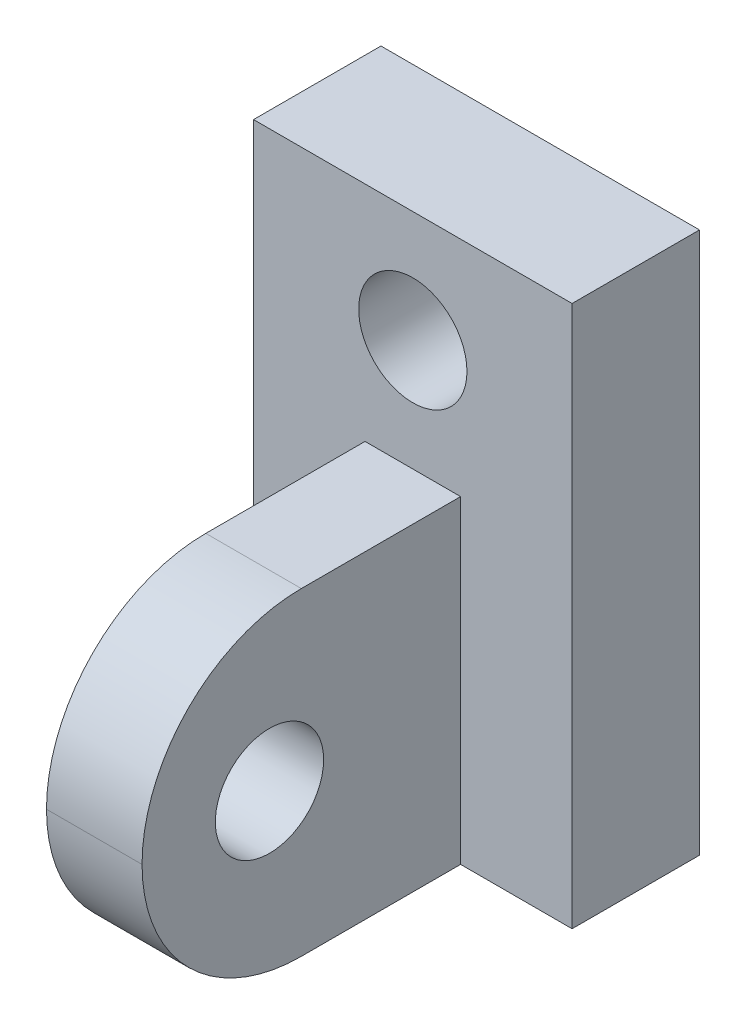
ISO-10303-21;
HEADER;
FILE_DESCRIPTION(('STEP AP214'),'2;1');
FILE_NAME('part.step','',(''),(''),'','','');
FILE_SCHEMA(('AUTOMOTIVE_DESIGN { 1 0 10303 214 1 1 1 1 }'));
ENDSEC;
DATA;
#1=APPLICATION_CONTEXT('core data for automotive mechanical design processes');
#2=APPLICATION_PROTOCOL_DEFINITION('international standard','automotive_design',2000,#1);
#3=PRODUCT_CONTEXT('',#1,'mechanical');
#4=PRODUCT('Part','Part','',(#3));
#5=PRODUCT_RELATED_PRODUCT_CATEGORY('part','',(#4));
#6=PRODUCT_DEFINITION_FORMATION('','',#4);
#7=PRODUCT_DEFINITION_CONTEXT('part definition',#1,'design');
#8=PRODUCT_DEFINITION('design','',#6,#7);
#9=PRODUCT_DEFINITION_SHAPE('','',#8);
#10=(LENGTH_UNIT() NAMED_UNIT(*) SI_UNIT(.MILLI.,.METRE.));
#11=(NAMED_UNIT(*) PLANE_ANGLE_UNIT() SI_UNIT($,.RADIAN.));
#12=(NAMED_UNIT(*) SI_UNIT($,.STERADIAN.) SOLID_ANGLE_UNIT());
#13=UNCERTAINTY_MEASURE_WITH_UNIT(LENGTH_MEASURE(1.E-05),#10,'distance_accuracy_value','');
#14=(GEOMETRIC_REPRESENTATION_CONTEXT(3) GLOBAL_UNCERTAINTY_ASSIGNED_CONTEXT((#13)) GLOBAL_UNIT_ASSIGNED_CONTEXT((#10,
#11,#12)) REPRESENTATION_CONTEXT('',''));
#15=CARTESIAN_POINT('',(0.,0.,0.));
#16=DIRECTION('',(0.,0.,1.));
#17=DIRECTION('',(1.,0.,0.));
#18=AXIS2_PLACEMENT_3D('',#15,#16,#17);
#19=CARTESIAN_POINT('',(0.,0.,4.));
#20=DIRECTION('',(-1.,0.,0.));
#21=DIRECTION('',(0.,0.,1.));
#22=AXIS2_PLACEMENT_3D('',#19,#20,#21);
#23=PLANE('',#22);
#24=DIRECTION('',(0.,1.,0.));
#25=VECTOR('',#24,1.);
#26=CARTESIAN_POINT('',(0.,0.,0.));
#27=LINE('',#26,#25);
#28=CARTESIAN_POINT('',(0.,0.,0.));
#29=VERTEX_POINT('',#28);
#30=CARTESIAN_POINT('',(0.,17.,0.));
#31=VERTEX_POINT('',#30);
#32=EDGE_CURVE('E191',#29,#31,#27,.T.);
#33=ORIENTED_EDGE('',*,*,#32,.F.);
#34=DIRECTION('',(0.,0.,-1.));
#35=VECTOR('',#34,1.);
#36=CARTESIAN_POINT('',(0.,0.,4.));
#37=LINE('',#36,#35);
#38=CARTESIAN_POINT('',(0.,0.,4.));
#39=VERTEX_POINT('',#38);
#40=EDGE_CURVE('E108',#39,#29,#37,.T.);
#41=ORIENTED_EDGE('',*,*,#40,.F.);
#42=DIRECTION('',(0.,1.,0.));
#43=VECTOR('',#42,1.);
#44=CARTESIAN_POINT('',(0.,0.,4.));
#45=LINE('',#44,#43);
#46=CARTESIAN_POINT('',(0.,17.,4.));
#47=VERTEX_POINT('',#46);
#48=EDGE_CURVE('E103',#39,#47,#45,.T.);
#49=ORIENTED_EDGE('',*,*,#48,.T.);
#50=DIRECTION('',(0.,0.,1.));
#51=VECTOR('',#50,1.);
#52=CARTESIAN_POINT('',(0.,17.,4.));
#53=LINE('',#52,#51);
#54=EDGE_CURVE('E107',#31,#47,#53,.T.);
#55=ORIENTED_EDGE('',*,*,#54,.F.);
#56=EDGE_LOOP('',(#33,#41,#49,#55));
#57=FACE_BOUND('',#56,.T.);
#58=ADVANCED_FACE('F34',(#57),#23,.T.);
#59=CARTESIAN_POINT('',(0.,0.,4.));
#60=DIRECTION('',(0.,1.,0.));
#61=DIRECTION('',(0.,0.,1.));
#62=AXIS2_PLACEMENT_3D('',#59,#60,#61);
#63=PLANE('',#62);
#64=DIRECTION('',(0.,0.,-1.));
#65=VECTOR('',#64,1.);
#66=CARTESIAN_POINT('',(6.5,0.,14.));
#67=LINE('',#66,#65);
#68=CARTESIAN_POINT('',(6.5,0.,9.));
#69=VERTEX_POINT('',#68);
#70=CARTESIAN_POINT('',(6.5,0.,4.));
#71=VERTEX_POINT('',#70);
#72=EDGE_CURVE('E155',#69,#71,#67,.T.);
#73=ORIENTED_EDGE('',*,*,#72,.F.);
#74=DIRECTION('',(1.,0.,0.));
#75=VECTOR('',#74,1.);
#76=CARTESIAN_POINT('',(3.5,0.,9.));
#77=LINE('',#76,#75);
#78=CARTESIAN_POINT('',(3.5,0.,9.));
#79=VERTEX_POINT('',#78);
#80=EDGE_CURVE('E166',#69,#79,#77,.F.);
#81=ORIENTED_EDGE('',*,*,#80,.T.);
#82=DIRECTION('',(0.,0.,-1.));
#83=VECTOR('',#82,1.);
#84=CARTESIAN_POINT('',(3.5,0.,14.));
#85=LINE('',#84,#83);
#86=CARTESIAN_POINT('',(3.5,0.,4.));
#87=VERTEX_POINT('',#86);
#88=EDGE_CURVE('E162',#79,#87,#85,.T.);
#89=ORIENTED_EDGE('',*,*,#88,.T.);
#90=DIRECTION('',(1.,0.,0.));
#91=VECTOR('',#90,1.);
#92=CARTESIAN_POINT('',(0.,0.,4.));
#93=LINE('',#92,#91);
#94=EDGE_CURVE('E184',#39,#87,#93,.T.);
#95=ORIENTED_EDGE('',*,*,#94,.F.);
#96=ORIENTED_EDGE('',*,*,#40,.T.);
#97=DIRECTION('',(1.,0.,0.));
#98=VECTOR('',#97,1.);
#99=CARTESIAN_POINT('',(0.,0.,0.));
#100=LINE('',#99,#98);
#101=CARTESIAN_POINT('',(10.,0.,0.));
#102=VERTEX_POINT('',#101);
#103=EDGE_CURVE('E193',#29,#102,#100,.T.);
#104=ORIENTED_EDGE('',*,*,#103,.T.);
#105=DIRECTION('',(0.,0.,-1.));
#106=VECTOR('',#105,1.);
#107=CARTESIAN_POINT('',(10.,0.,4.));
#108=LINE('',#107,#106);
#109=CARTESIAN_POINT('',(10.,0.,4.));
#110=VERTEX_POINT('',#109);
#111=EDGE_CURVE('E190',#110,#102,#108,.T.);
#112=ORIENTED_EDGE('',*,*,#111,.F.);
#113=EDGE_CURVE('E112',#71,#110,#93,.T.);
#114=ORIENTED_EDGE('',*,*,#113,.F.);
#115=EDGE_LOOP('',(#73,#81,#89,#95,#96,#104,#112,#114));
#116=FACE_BOUND('',#115,.T.);
#117=ADVANCED_FACE('F206',(#116),#63,.F.);
#118=CARTESIAN_POINT('',(10.,0.,4.));
#119=DIRECTION('',(-1.,0.,0.));
#120=DIRECTION('',(0.,0.,1.));
#121=AXIS2_PLACEMENT_3D('',#118,#119,#120);
#122=PLANE('',#121);
#123=DIRECTION('',(0.,1.,0.));
#124=VECTOR('',#123,1.);
#125=CARTESIAN_POINT('',(10.,0.,0.));
#126=LINE('',#125,#124);
#127=CARTESIAN_POINT('',(10.,17.,0.));
#128=VERTEX_POINT('',#127);
#129=EDGE_CURVE('E113',#102,#128,#126,.T.);
#130=ORIENTED_EDGE('',*,*,#129,.T.);
#131=DIRECTION('',(0.,0.,-1.));
#132=VECTOR('',#131,1.);
#133=CARTESIAN_POINT('',(10.,17.,4.));
#134=LINE('',#133,#132);
#135=CARTESIAN_POINT('',(10.,17.,4.));
#136=VERTEX_POINT('',#135);
#137=EDGE_CURVE('E123',#136,#128,#134,.T.);
#138=ORIENTED_EDGE('',*,*,#137,.F.);
#139=DIRECTION('',(0.,1.,0.));
#140=VECTOR('',#139,1.);
#141=CARTESIAN_POINT('',(10.,0.,4.));
#142=LINE('',#141,#140);
#143=EDGE_CURVE('E119',#110,#136,#142,.T.);
#144=ORIENTED_EDGE('',*,*,#143,.F.);
#145=ORIENTED_EDGE('',*,*,#111,.T.);
#146=EDGE_LOOP('',(#130,#138,#144,#145));
#147=FACE_BOUND('',#146,.T.);
#148=ADVANCED_FACE('F224',(#147),#122,.F.);
#149=CARTESIAN_POINT('',(0.,0.,4.));
#150=DIRECTION('',(0.,0.,1.));
#151=DIRECTION('',(1.,0.,0.));
#152=AXIS2_PLACEMENT_3D('',#149,#150,#151);
#153=PLANE('',#152);
#154=CARTESIAN_POINT('',(5.,13.5,4.));
#155=DIRECTION('',(0.,0.,1.));
#156=DIRECTION('',(1.,0.,0.));
#157=AXIS2_PLACEMENT_3D('',#154,#155,#156);
#158=CIRCLE('',#157,1.69999999999999);
#159=CARTESIAN_POINT('',(6.69999999999999,13.5,4.));
#160=VERTEX_POINT('',#159);
#161=EDGE_CURVE('E138',#160,#160,#158,.T.);
#162=ORIENTED_EDGE('',*,*,#161,.F.);
#163=EDGE_LOOP('',(#162));
#164=FACE_BOUND('',#163,.T.);
#165=DIRECTION('',(1.,0.,0.));
#166=VECTOR('',#165,1.);
#167=CARTESIAN_POINT('',(0.,17.,4.));
#168=LINE('',#167,#166);
#169=EDGE_CURVE('E116',#47,#136,#168,.T.);
#170=ORIENTED_EDGE('',*,*,#169,.F.);
#171=ORIENTED_EDGE('',*,*,#48,.F.);
#172=ORIENTED_EDGE('',*,*,#94,.T.);
#173=DIRECTION('',(0.,-1.,0.));
#174=VECTOR('',#173,1.);
#175=CARTESIAN_POINT('',(3.5,10.,4.));
#176=LINE('',#175,#174);
#177=CARTESIAN_POINT('',(3.5,10.,4.));
#178=VERTEX_POINT('',#177);
#179=EDGE_CURVE('E145',#178,#87,#176,.T.);
#180=ORIENTED_EDGE('',*,*,#179,.F.);
#181=DIRECTION('',(-1.,0.,0.));
#182=VECTOR('',#181,1.);
#183=CARTESIAN_POINT('',(3.5,10.,4.));
#184=LINE('',#183,#182);
#185=CARTESIAN_POINT('',(6.5,10.,4.));
#186=VERTEX_POINT('',#185);
#187=EDGE_CURVE('E142',#186,#178,#184,.T.);
#188=ORIENTED_EDGE('',*,*,#187,.F.);
#189=DIRECTION('',(0.,1.,0.));
#190=VECTOR('',#189,1.);
#191=CARTESIAN_POINT('',(6.5,10.,4.));
#192=LINE('',#191,#190);
#193=EDGE_CURVE('E146',#71,#186,#192,.T.);
#194=ORIENTED_EDGE('',*,*,#193,.F.);
#195=ORIENTED_EDGE('',*,*,#113,.T.);
#196=ORIENTED_EDGE('',*,*,#143,.T.);
#197=EDGE_LOOP('',(#170,#171,#172,#180,#188,#194,#195,#196));
#198=FACE_BOUND('',#197,.T.);
#199=ADVANCED_FACE('F117',(#164,#198),#153,.T.);
#200=CARTESIAN_POINT('',(0.,0.,0.));
#201=DIRECTION('',(0.,0.,1.));
#202=DIRECTION('',(1.,0.,0.));
#203=AXIS2_PLACEMENT_3D('',#200,#201,#202);
#204=PLANE('',#203);
#205=CARTESIAN_POINT('',(5.,13.5,0.));
#206=DIRECTION('',(0.,0.,1.));
#207=DIRECTION('',(1.,0.,0.));
#208=AXIS2_PLACEMENT_3D('',#205,#206,#207);
#209=CIRCLE('',#208,1.69999999999999);
#210=CARTESIAN_POINT('',(6.69999999999999,13.5,0.));
#211=VERTEX_POINT('',#210);
#212=EDGE_CURVE('E11',#211,#211,#209,.T.);
#213=ORIENTED_EDGE('',*,*,#212,.T.);
#214=EDGE_LOOP('',(#213));
#215=FACE_BOUND('',#214,.T.);
#216=ORIENTED_EDGE('',*,*,#32,.T.);
#217=DIRECTION('',(-1.,0.,0.));
#218=VECTOR('',#217,1.);
#219=CARTESIAN_POINT('',(0.,17.,0.));
#220=LINE('',#219,#218);
#221=EDGE_CURVE('E128',#128,#31,#220,.T.);
#222=ORIENTED_EDGE('',*,*,#221,.F.);
#223=ORIENTED_EDGE('',*,*,#129,.F.);
#224=ORIENTED_EDGE('',*,*,#103,.F.);
#225=EDGE_LOOP('',(#216,#222,#223,#224));
#226=FACE_BOUND('',#225,.T.);
#227=ADVANCED_FACE('F230',(#215,#226),#204,.F.);
#228=CARTESIAN_POINT('',(6.5,10.,14.));
#229=DIRECTION('',(-1.,0.,0.));
#230=DIRECTION('',(0.,-1.,0.));
#231=AXIS2_PLACEMENT_3D('',#228,#229,#230);
#232=PLANE('',#231);
#233=CARTESIAN_POINT('',(6.5,5.,10.));
#234=DIRECTION('',(1.,0.,0.));
#235=DIRECTION('',(0.,0.,-1.));
#236=AXIS2_PLACEMENT_3D('',#233,#234,#235);
#237=CIRCLE('',#236,1.69999999999999);
#238=CARTESIAN_POINT('',(6.5,5.,8.30000000000001));
#239=VERTEX_POINT('',#238);
#240=EDGE_CURVE('E132',#239,#239,#237,.T.);
#241=ORIENTED_EDGE('',*,*,#240,.F.);
#242=EDGE_LOOP('',(#241));
#243=FACE_BOUND('',#242,.T.);
#244=CARTESIAN_POINT('',(6.5,5.,9.));
#245=DIRECTION('',(-1.,0.,0.));
#246=DIRECTION('',(0.,-1.,0.));
#247=AXIS2_PLACEMENT_3D('',#244,#245,#246);
#248=CIRCLE('',#247,5.);
#249=CARTESIAN_POINT('',(6.5,10.,9.));
#250=VERTEX_POINT('',#249);
#251=CARTESIAN_POINT('',(6.5,5.,14.));
#252=VERTEX_POINT('',#251);
#253=EDGE_CURVE('E198',#250,#252,#248,.F.);
#254=ORIENTED_EDGE('',*,*,#253,.T.);
#255=CARTESIAN_POINT('',(6.5,5.,9.));
#256=DIRECTION('',(-1.,0.,0.));
#257=DIRECTION('',(0.,-1.,0.));
#258=AXIS2_PLACEMENT_3D('',#255,#256,#257);
#259=CIRCLE('',#258,5.);
#260=EDGE_CURVE('E165',#252,#69,#259,.F.);
#261=ORIENTED_EDGE('',*,*,#260,.T.);
#262=ORIENTED_EDGE('',*,*,#72,.T.);
#263=ORIENTED_EDGE('',*,*,#193,.T.);
#264=DIRECTION('',(0.,0.,-1.));
#265=VECTOR('',#264,1.);
#266=CARTESIAN_POINT('',(6.5,10.,14.));
#267=LINE('',#266,#265);
#268=EDGE_CURVE('E194',#250,#186,#267,.T.);
#269=ORIENTED_EDGE('',*,*,#268,.F.);
#270=EDGE_LOOP('',(#254,#261,#262,#263,#269));
#271=FACE_BOUND('',#270,.T.);
#272=ADVANCED_FACE('F203',(#243,#271),#232,.F.);
#273=CARTESIAN_POINT('',(3.5,10.,14.));
#274=DIRECTION('',(0.,-1.,0.));
#275=DIRECTION('',(0.,0.,-1.));
#276=AXIS2_PLACEMENT_3D('',#273,#274,#275);
#277=PLANE('',#276);
#278=DIRECTION('',(0.,0.,-1.));
#279=VECTOR('',#278,1.);
#280=CARTESIAN_POINT('',(3.5,10.,14.));
#281=LINE('',#280,#279);
#282=CARTESIAN_POINT('',(3.5,10.,9.));
#283=VERTEX_POINT('',#282);
#284=EDGE_CURVE('E149',#283,#178,#281,.T.);
#285=ORIENTED_EDGE('',*,*,#284,.F.);
#286=DIRECTION('',(-1.,0.,0.));
#287=VECTOR('',#286,1.);
#288=CARTESIAN_POINT('',(6.5,10.,9.));
#289=LINE('',#288,#287);
#290=EDGE_CURVE('E42',#283,#250,#289,.F.);
#291=ORIENTED_EDGE('',*,*,#290,.T.);
#292=ORIENTED_EDGE('',*,*,#268,.T.);
#293=ORIENTED_EDGE('',*,*,#187,.T.);
#294=EDGE_LOOP('',(#285,#291,#292,#293));
#295=FACE_BOUND('',#294,.T.);
#296=ADVANCED_FACE('F239',(#295),#277,.F.);
#297=CARTESIAN_POINT('',(3.5,10.,14.));
#298=DIRECTION('',(1.,0.,0.));
#299=DIRECTION('',(0.,0.,-1.));
#300=AXIS2_PLACEMENT_3D('',#297,#298,#299);
#301=PLANE('',#300);
#302=CARTESIAN_POINT('',(3.5,5.,10.));
#303=DIRECTION('',(1.,0.,0.));
#304=DIRECTION('',(0.,0.,-1.));
#305=AXIS2_PLACEMENT_3D('',#302,#303,#304);
#306=CIRCLE('',#305,1.69999999999999);
#307=CARTESIAN_POINT('',(3.5,5.,8.30000000000001));
#308=VERTEX_POINT('',#307);
#309=EDGE_CURVE('E129',#308,#308,#306,.T.);
#310=ORIENTED_EDGE('',*,*,#309,.T.);
#311=EDGE_LOOP('',(#310));
#312=FACE_BOUND('',#311,.T.);
#313=ORIENTED_EDGE('',*,*,#88,.F.);
#314=CARTESIAN_POINT('',(3.5,5.,9.));
#315=DIRECTION('',(1.,0.,0.));
#316=DIRECTION('',(0.,0.,-1.));
#317=AXIS2_PLACEMENT_3D('',#314,#315,#316);
#318=CIRCLE('',#317,5.);
#319=CARTESIAN_POINT('',(3.5,5.,14.));
#320=VERTEX_POINT('',#319);
#321=EDGE_CURVE('E54',#79,#320,#318,.F.);
#322=ORIENTED_EDGE('',*,*,#321,.T.);
#323=CARTESIAN_POINT('',(3.5,5.,9.));
#324=DIRECTION('',(1.,0.,0.));
#325=DIRECTION('',(0.,0.,-1.));
#326=AXIS2_PLACEMENT_3D('',#323,#324,#325);
#327=CIRCLE('',#326,5.);
#328=EDGE_CURVE('E49',#320,#283,#327,.F.);
#329=ORIENTED_EDGE('',*,*,#328,.T.);
#330=ORIENTED_EDGE('',*,*,#284,.T.);
#331=ORIENTED_EDGE('',*,*,#179,.T.);
#332=EDGE_LOOP('',(#313,#322,#329,#330,#331));
#333=FACE_BOUND('',#332,.T.);
#334=ADVANCED_FACE('F217',(#312,#333),#301,.F.);
#335=CARTESIAN_POINT('',(0.,5.,9.));
#336=DIRECTION('',(1.,0.,0.));
#337=DIRECTION('',(0.,0.,-1.));
#338=AXIS2_PLACEMENT_3D('',#335,#336,#337);
#339=CYLINDRICAL_SURFACE('',#338,5.);
#340=ORIENTED_EDGE('',*,*,#290,.F.);
#341=ORIENTED_EDGE('',*,*,#328,.F.);
#342=DIRECTION('',(-1.,0.,0.));
#343=VECTOR('',#342,1.);
#344=CARTESIAN_POINT('',(3.5,5.,14.));
#345=LINE('',#344,#343);
#346=EDGE_CURVE('E141',#252,#320,#345,.T.);
#347=ORIENTED_EDGE('',*,*,#346,.F.);
#348=ORIENTED_EDGE('',*,*,#253,.F.);
#349=EDGE_LOOP('',(#340,#341,#347,#348));
#350=FACE_BOUND('',#349,.T.);
#351=ADVANCED_FACE('F36',(#350),#339,.T.);
#352=CARTESIAN_POINT('',(0.,5.,9.));
#353=DIRECTION('',(-1.,0.,0.));
#354=DIRECTION('',(0.,0.,1.));
#355=AXIS2_PLACEMENT_3D('',#352,#353,#354);
#356=CYLINDRICAL_SURFACE('',#355,5.);
#357=ORIENTED_EDGE('',*,*,#321,.F.);
#358=ORIENTED_EDGE('',*,*,#80,.F.);
#359=ORIENTED_EDGE('',*,*,#260,.F.);
#360=ORIENTED_EDGE('',*,*,#346,.T.);
#361=EDGE_LOOP('',(#357,#358,#359,#360));
#362=FACE_BOUND('',#361,.T.);
#363=ADVANCED_FACE('F208',(#362),#356,.T.);
#364=CARTESIAN_POINT('',(5.,13.5,4.));
#365=DIRECTION('',(0.,0.,1.));
#366=DIRECTION('',(1.,0.,0.));
#367=AXIS2_PLACEMENT_3D('',#364,#365,#366);
#368=CYLINDRICAL_SURFACE('',#367,1.69999999999999);
#369=ORIENTED_EDGE('',*,*,#212,.F.);
#370=EDGE_LOOP('',(#369));
#371=FACE_BOUND('',#370,.T.);
#372=ORIENTED_EDGE('',*,*,#161,.T.);
#373=EDGE_LOOP('',(#372));
#374=FACE_BOUND('',#373,.T.);
#375=ADVANCED_FACE('F210',(#371,#374),#368,.F.);
#376=CARTESIAN_POINT('',(0.,17.,0.));
#377=DIRECTION('',(0.,-1.,0.));
#378=DIRECTION('',(0.,0.,-1.));
#379=AXIS2_PLACEMENT_3D('',#376,#377,#378);
#380=PLANE('',#379);
#381=ORIENTED_EDGE('',*,*,#54,.T.);
#382=ORIENTED_EDGE('',*,*,#169,.T.);
#383=ORIENTED_EDGE('',*,*,#137,.T.);
#384=ORIENTED_EDGE('',*,*,#221,.T.);
#385=EDGE_LOOP('',(#381,#382,#383,#384));
#386=FACE_BOUND('',#385,.T.);
#387=ADVANCED_FACE('F126',(#386),#380,.F.);
#388=CARTESIAN_POINT('',(6.5,5.,10.));
#389=DIRECTION('',(1.,0.,0.));
#390=DIRECTION('',(0.,0.,-1.));
#391=AXIS2_PLACEMENT_3D('',#388,#389,#390);
#392=CYLINDRICAL_SURFACE('',#391,1.69999999999999);
#393=ORIENTED_EDGE('',*,*,#240,.T.);
#394=EDGE_LOOP('',(#393));
#395=FACE_BOUND('',#394,.T.);
#396=ORIENTED_EDGE('',*,*,#309,.F.);
#397=EDGE_LOOP('',(#396));
#398=FACE_BOUND('',#397,.T.);
#399=ADVANCED_FACE('F249',(#395,#398),#392,.F.);
#400=CLOSED_SHELL('',(#58,#117,#148,#199,#227,#272,#296,#334,#351,#363,#375,#387,#399));
#401=MANIFOLD_SOLID_BREP('B2',#400);
#402=ADVANCED_BREP_SHAPE_REPRESENTATION('',(#18,#401),#14);
#403=SHAPE_DEFINITION_REPRESENTATION(#9,#402);
ENDSEC;
END-ISO-10303-21;
